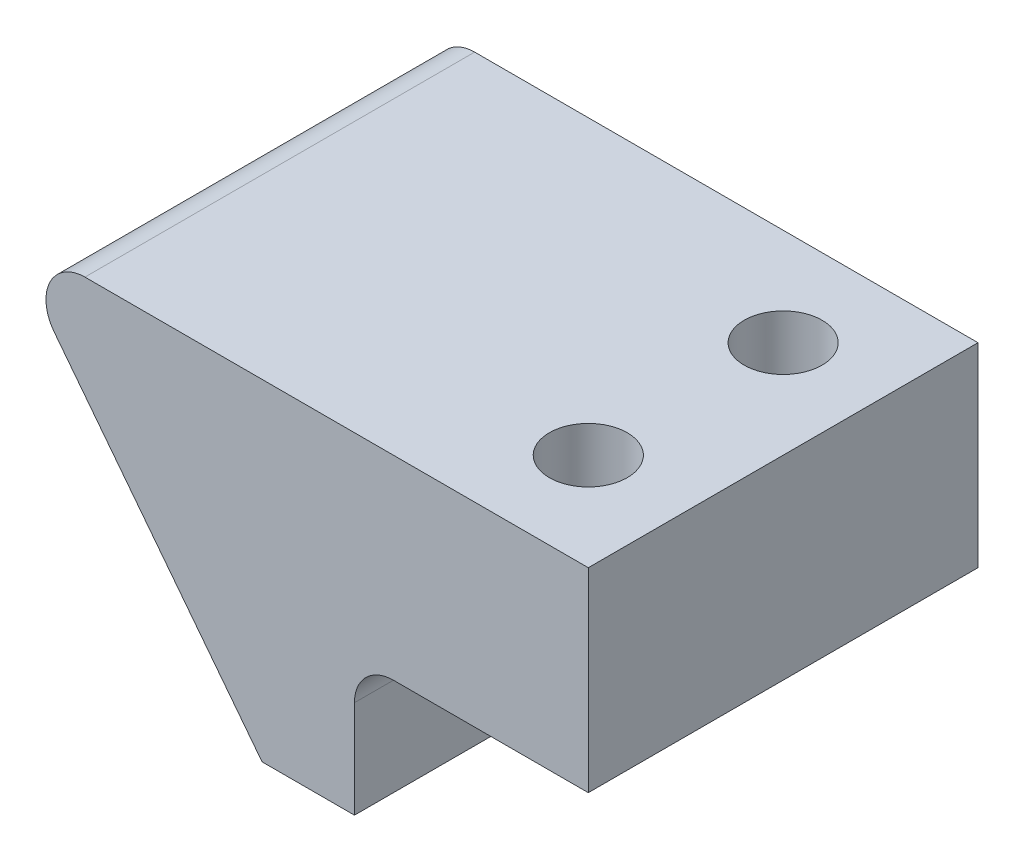
ISO-10303-21;
HEADER;
FILE_DESCRIPTION(('STEP AP214'),'2;1');
FILE_NAME('part.step','',(''),(''),'','','');
FILE_SCHEMA(('AUTOMOTIVE_DESIGN { 1 0 10303 214 1 1 1 1 }'));
ENDSEC;
DATA;
#1=APPLICATION_CONTEXT('core data for automotive mechanical design processes');
#2=APPLICATION_PROTOCOL_DEFINITION('international standard','automotive_design',2000,#1);
#3=PRODUCT_CONTEXT('',#1,'mechanical');
#4=PRODUCT('Part','Part','',(#3));
#5=PRODUCT_RELATED_PRODUCT_CATEGORY('part','',(#4));
#6=PRODUCT_DEFINITION_FORMATION('','',#4);
#7=PRODUCT_DEFINITION_CONTEXT('part definition',#1,'design');
#8=PRODUCT_DEFINITION('design','',#6,#7);
#9=PRODUCT_DEFINITION_SHAPE('','',#8);
#10=(LENGTH_UNIT() NAMED_UNIT(*) SI_UNIT(.MILLI.,.METRE.));
#11=(NAMED_UNIT(*) PLANE_ANGLE_UNIT() SI_UNIT($,.RADIAN.));
#12=(NAMED_UNIT(*) SI_UNIT($,.STERADIAN.) SOLID_ANGLE_UNIT());
#13=UNCERTAINTY_MEASURE_WITH_UNIT(LENGTH_MEASURE(1.E-05),#10,'distance_accuracy_value','');
#14=(GEOMETRIC_REPRESENTATION_CONTEXT(3) GLOBAL_UNCERTAINTY_ASSIGNED_CONTEXT((#13)) GLOBAL_UNIT_ASSIGNED_CONTEXT((#10,
#11,#12)) REPRESENTATION_CONTEXT('',''));
#15=CARTESIAN_POINT('',(0.,0.,0.));
#16=DIRECTION('',(0.,0.,1.));
#17=DIRECTION('',(1.,0.,0.));
#18=AXIS2_PLACEMENT_3D('',#15,#16,#17);
#19=CARTESIAN_POINT('',(21.6293199223756,10.5,-5.));
#20=DIRECTION('',(-0.79051636866041,-0.612440912153947,0.));
#21=DIRECTION('',(0.612440912153947,-0.79051636866041,0.));
#22=AXIS2_PLACEMENT_3D('',#19,#20,#21);
#23=PLANE('',#22);
#24=DIRECTION('',(0.612440912153947,-0.79051636866041,0.));
#25=VECTOR('',#24,1.);
#26=CARTESIAN_POINT('',(21.6293199223756,10.5,5.));
#27=LINE('',#26,#25);
#28=CARTESIAN_POINT('',(16.2932849742028,17.3875590878461,5.));
#29=VERTEX_POINT('',#28);
#30=CARTESIAN_POINT('',(21.6293199223756,10.5,5.));
#31=VERTEX_POINT('',#30);
#32=EDGE_CURVE('E105',#29,#31,#27,.T.);
#33=ORIENTED_EDGE('',*,*,#32,.F.);
#34=DIRECTION('',(0.,0.,1.));
#35=VECTOR('',#34,1.);
#36=CARTESIAN_POINT('',(16.2932849742028,17.3875590878461,-5.));
#37=LINE('',#36,#35);
#38=CARTESIAN_POINT('',(16.2932849742028,17.3875590878461,-5.));
#39=VERTEX_POINT('',#38);
#40=EDGE_CURVE('E58',#29,#39,#37,.F.);
#41=ORIENTED_EDGE('',*,*,#40,.T.);
#42=DIRECTION('',(0.612440912153947,-0.79051636866041,0.));
#43=VECTOR('',#42,1.);
#44=CARTESIAN_POINT('',(21.6293199223756,10.5,-5.));
#45=LINE('',#44,#43);
#46=CARTESIAN_POINT('',(21.6293199223756,10.5,-5.));
#47=VERTEX_POINT('',#46);
#48=EDGE_CURVE('E116',#39,#47,#45,.T.);
#49=ORIENTED_EDGE('',*,*,#48,.T.);
#50=DIRECTION('',(0.,0.,1.));
#51=VECTOR('',#50,1.);
#52=CARTESIAN_POINT('',(21.6293199223756,10.5,-5.));
#53=LINE('',#52,#51);
#54=EDGE_CURVE('E115',#47,#31,#53,.T.);
#55=ORIENTED_EDGE('',*,*,#54,.T.);
#56=EDGE_LOOP('',(#33,#41,#49,#55));
#57=FACE_BOUND('',#56,.T.);
#58=ADVANCED_FACE('F43',(#57),#23,.T.);
#59=CARTESIAN_POINT('',(15.0440701290917,19.,-5.));
#60=DIRECTION('',(0.,1.,0.));
#61=DIRECTION('',(-1.,0.,0.));
#62=AXIS2_PLACEMENT_3D('',#59,#60,#61);
#63=PLANE('',#62);
#64=CARTESIAN_POINT('',(27.5,19.,-2.49999996687377));
#65=DIRECTION('',(0.,-1.,0.));
#66=DIRECTION('',(0.,0.,-1.));
#67=AXIS2_PLACEMENT_3D('',#64,#65,#66);
#68=CIRCLE('',#67,0.999999999999997);
#69=CARTESIAN_POINT('',(27.5,19.,-3.49999996687376));
#70=VERTEX_POINT('',#69);
#71=EDGE_CURVE('E261',#70,#70,#68,.T.);
#72=ORIENTED_EDGE('',*,*,#71,.T.);
#73=EDGE_LOOP('',(#72));
#74=FACE_BOUND('',#73,.T.);
#75=CARTESIAN_POINT('',(27.5,19.,2.50000003312623));
#76=DIRECTION('',(0.,-1.,0.));
#77=DIRECTION('',(0.,0.,-1.));
#78=AXIS2_PLACEMENT_3D('',#75,#76,#77);
#79=CIRCLE('',#78,0.999999999999997);
#80=CARTESIAN_POINT('',(27.5,19.,1.50000003312624));
#81=VERTEX_POINT('',#80);
#82=EDGE_CURVE('E112',#81,#81,#79,.T.);
#83=ORIENTED_EDGE('',*,*,#82,.T.);
#84=EDGE_LOOP('',(#83));
#85=FACE_BOUND('',#84,.T.);
#86=DIRECTION('',(-1.,0.,0.));
#87=VECTOR('',#86,1.);
#88=CARTESIAN_POINT('',(15.0440701290917,19.,-5.));
#89=LINE('',#88,#87);
#90=CARTESIAN_POINT('',(30.,19.,-5.));
#91=VERTEX_POINT('',#90);
#92=CARTESIAN_POINT('',(17.0838013428632,19.,-5.));
#93=VERTEX_POINT('',#92);
#94=EDGE_CURVE('E121',#91,#93,#89,.T.);
#95=ORIENTED_EDGE('',*,*,#94,.T.);
#96=DIRECTION('',(0.,0.,1.));
#97=VECTOR('',#96,1.);
#98=CARTESIAN_POINT('',(17.0838013428632,19.,-5.));
#99=LINE('',#98,#97);
#100=CARTESIAN_POINT('',(17.0838013428632,19.,5.));
#101=VERTEX_POINT('',#100);
#102=EDGE_CURVE('E160',#93,#101,#99,.T.);
#103=ORIENTED_EDGE('',*,*,#102,.T.);
#104=DIRECTION('',(-1.,0.,0.));
#105=VECTOR('',#104,1.);
#106=CARTESIAN_POINT('',(15.0440701290917,19.,5.));
#107=LINE('',#106,#105);
#108=CARTESIAN_POINT('',(30.,19.,5.));
#109=VERTEX_POINT('',#108);
#110=EDGE_CURVE('E134',#109,#101,#107,.T.);
#111=ORIENTED_EDGE('',*,*,#110,.F.);
#112=DIRECTION('',(0.,0.,1.));
#113=VECTOR('',#112,1.);
#114=CARTESIAN_POINT('',(30.,19.,-5.));
#115=LINE('',#114,#113);
#116=EDGE_CURVE('E149',#91,#109,#115,.T.);
#117=ORIENTED_EDGE('',*,*,#116,.F.);
#118=EDGE_LOOP('',(#95,#103,#111,#117));
#119=FACE_BOUND('',#118,.T.);
#120=ADVANCED_FACE('F195',(#74,#85,#119),#63,.T.);
#121=CARTESIAN_POINT('',(30.,19.,-5.));
#122=DIRECTION('',(1.,0.,0.));
#123=DIRECTION('',(0.,1.,0.));
#124=AXIS2_PLACEMENT_3D('',#121,#122,#123);
#125=PLANE('',#124);
#126=ORIENTED_EDGE('',*,*,#116,.T.);
#127=DIRECTION('',(0.,1.,0.));
#128=VECTOR('',#127,1.);
#129=CARTESIAN_POINT('',(30.,19.,5.));
#130=LINE('',#129,#128);
#131=CARTESIAN_POINT('',(30.,14.,5.));
#132=VERTEX_POINT('',#131);
#133=EDGE_CURVE('E131',#132,#109,#130,.T.);
#134=ORIENTED_EDGE('',*,*,#133,.F.);
#135=DIRECTION('',(0.,0.,1.));
#136=VECTOR('',#135,1.);
#137=CARTESIAN_POINT('',(30.,14.,-5.));
#138=LINE('',#137,#136);
#139=CARTESIAN_POINT('',(30.,14.,-5.));
#140=VERTEX_POINT('',#139);
#141=EDGE_CURVE('E152',#140,#132,#138,.T.);
#142=ORIENTED_EDGE('',*,*,#141,.F.);
#143=DIRECTION('',(0.,1.,0.));
#144=VECTOR('',#143,1.);
#145=CARTESIAN_POINT('',(30.,19.,-5.));
#146=LINE('',#145,#144);
#147=EDGE_CURVE('E144',#140,#91,#146,.T.);
#148=ORIENTED_EDGE('',*,*,#147,.T.);
#149=EDGE_LOOP('',(#126,#134,#142,#148));
#150=FACE_BOUND('',#149,.T.);
#151=ADVANCED_FACE('F191',(#150),#125,.T.);
#152=CARTESIAN_POINT('',(30.,14.,-5.));
#153=DIRECTION('',(0.,-1.,0.));
#154=DIRECTION('',(0.,0.,-1.));
#155=AXIS2_PLACEMENT_3D('',#152,#153,#154);
#156=PLANE('',#155);
#157=CARTESIAN_POINT('',(27.5,14.,-2.49999996687377));
#158=DIRECTION('',(0.,-1.,0.));
#159=DIRECTION('',(0.,0.,-1.));
#160=AXIS2_PLACEMENT_3D('',#157,#158,#159);
#161=CIRCLE('',#160,1.);
#162=CARTESIAN_POINT('',(27.5,14.,-3.49999996687377));
#163=VERTEX_POINT('',#162);
#164=EDGE_CURVE('E264',#163,#163,#161,.T.);
#165=ORIENTED_EDGE('',*,*,#164,.F.);
#166=EDGE_LOOP('',(#165));
#167=FACE_BOUND('',#166,.T.);
#168=CARTESIAN_POINT('',(27.5,14.,2.50000003312623));
#169=DIRECTION('',(0.,-1.,0.));
#170=DIRECTION('',(0.,0.,-1.));
#171=AXIS2_PLACEMENT_3D('',#168,#169,#170);
#172=CIRCLE('',#171,1.);
#173=CARTESIAN_POINT('',(27.5,14.,1.50000003312623));
#174=VERTEX_POINT('',#173);
#175=EDGE_CURVE('E266',#174,#174,#172,.T.);
#176=ORIENTED_EDGE('',*,*,#175,.F.);
#177=EDGE_LOOP('',(#176));
#178=FACE_BOUND('',#177,.T.);
#179=DIRECTION('',(1.,0.,0.));
#180=VECTOR('',#179,1.);
#181=CARTESIAN_POINT('',(30.,14.,5.));
#182=LINE('',#181,#180);
#183=CARTESIAN_POINT('',(25.,14.,5.));
#184=VERTEX_POINT('',#183);
#185=EDGE_CURVE('E126',#184,#132,#182,.T.);
#186=ORIENTED_EDGE('',*,*,#185,.F.);
#187=DIRECTION('',(0.,0.,1.));
#188=VECTOR('',#187,1.);
#189=CARTESIAN_POINT('',(25.,14.,-5.));
#190=LINE('',#189,#188);
#191=CARTESIAN_POINT('',(25.,14.,-5.));
#192=VERTEX_POINT('',#191);
#193=EDGE_CURVE('E158',#184,#192,#190,.F.);
#194=ORIENTED_EDGE('',*,*,#193,.T.);
#195=DIRECTION('',(1.,0.,0.));
#196=VECTOR('',#195,1.);
#197=CARTESIAN_POINT('',(30.,14.,-5.));
#198=LINE('',#197,#196);
#199=EDGE_CURVE('E142',#192,#140,#198,.T.);
#200=ORIENTED_EDGE('',*,*,#199,.T.);
#201=ORIENTED_EDGE('',*,*,#141,.T.);
#202=EDGE_LOOP('',(#186,#194,#200,#201));
#203=FACE_BOUND('',#202,.T.);
#204=ADVANCED_FACE('F171',(#167,#178,#203),#156,.T.);
#205=CARTESIAN_POINT('',(24.,14.,-5.));
#206=DIRECTION('',(1.,0.,0.));
#207=DIRECTION('',(0.,0.,-1.));
#208=AXIS2_PLACEMENT_3D('',#205,#206,#207);
#209=PLANE('',#208);
#210=DIRECTION('',(0.,1.,0.));
#211=VECTOR('',#210,1.);
#212=CARTESIAN_POINT('',(24.,14.,-5.));
#213=LINE('',#212,#211);
#214=CARTESIAN_POINT('',(24.,10.5,-5.));
#215=VERTEX_POINT('',#214);
#216=CARTESIAN_POINT('',(24.,13.,-5.));
#217=VERTEX_POINT('',#216);
#218=EDGE_CURVE('E139',#215,#217,#213,.T.);
#219=ORIENTED_EDGE('',*,*,#218,.T.);
#220=DIRECTION('',(0.,0.,1.));
#221=VECTOR('',#220,1.);
#222=CARTESIAN_POINT('',(24.,13.,5.));
#223=LINE('',#222,#221);
#224=CARTESIAN_POINT('',(24.,13.,5.));
#225=VERTEX_POINT('',#224);
#226=EDGE_CURVE('E151',#217,#225,#223,.T.);
#227=ORIENTED_EDGE('',*,*,#226,.T.);
#228=DIRECTION('',(0.,1.,0.));
#229=VECTOR('',#228,1.);
#230=CARTESIAN_POINT('',(24.,14.,5.));
#231=LINE('',#230,#229);
#232=CARTESIAN_POINT('',(24.,10.5,5.));
#233=VERTEX_POINT('',#232);
#234=EDGE_CURVE('E124',#233,#225,#231,.T.);
#235=ORIENTED_EDGE('',*,*,#234,.F.);
#236=DIRECTION('',(0.,0.,1.));
#237=VECTOR('',#236,1.);
#238=CARTESIAN_POINT('',(24.,10.5,-5.));
#239=LINE('',#238,#237);
#240=EDGE_CURVE('E120',#215,#233,#239,.T.);
#241=ORIENTED_EDGE('',*,*,#240,.F.);
#242=EDGE_LOOP('',(#219,#227,#235,#241));
#243=FACE_BOUND('',#242,.T.);
#244=ADVANCED_FACE('F182',(#243),#209,.T.);
#245=CARTESIAN_POINT('',(24.,10.5,-5.));
#246=DIRECTION('',(0.,-1.,0.));
#247=DIRECTION('',(0.,0.,-1.));
#248=AXIS2_PLACEMENT_3D('',#245,#246,#247);
#249=PLANE('',#248);
#250=ORIENTED_EDGE('',*,*,#240,.T.);
#251=DIRECTION('',(1.,0.,0.));
#252=VECTOR('',#251,1.);
#253=CARTESIAN_POINT('',(24.,10.5,5.));
#254=LINE('',#253,#252);
#255=EDGE_CURVE('E110',#31,#233,#254,.T.);
#256=ORIENTED_EDGE('',*,*,#255,.F.);
#257=ORIENTED_EDGE('',*,*,#54,.F.);
#258=DIRECTION('',(1.,0.,0.));
#259=VECTOR('',#258,1.);
#260=CARTESIAN_POINT('',(24.,10.5,-5.));
#261=LINE('',#260,#259);
#262=EDGE_CURVE('E137',#47,#215,#261,.T.);
#263=ORIENTED_EDGE('',*,*,#262,.T.);
#264=EDGE_LOOP('',(#250,#256,#257,#263));
#265=FACE_BOUND('',#264,.T.);
#266=ADVANCED_FACE('F123',(#265),#249,.T.);
#267=CARTESIAN_POINT('',(0.,0.,-5.));
#268=DIRECTION('',(0.,0.,-1.));
#269=DIRECTION('',(-1.,0.,0.));
#270=AXIS2_PLACEMENT_3D('',#267,#268,#269);
#271=PLANE('',#270);
#272=ORIENTED_EDGE('',*,*,#48,.F.);
#273=CARTESIAN_POINT('',(17.0838013428632,18.,-5.));
#274=DIRECTION('',(0.,0.,-1.));
#275=DIRECTION('',(-1.,0.,0.));
#276=AXIS2_PLACEMENT_3D('',#273,#274,#275);
#277=CIRCLE('',#276,1.);
#278=EDGE_CURVE('E165',#39,#93,#277,.T.);
#279=ORIENTED_EDGE('',*,*,#278,.T.);
#280=ORIENTED_EDGE('',*,*,#94,.F.);
#281=ORIENTED_EDGE('',*,*,#147,.F.);
#282=ORIENTED_EDGE('',*,*,#199,.F.);
#283=CARTESIAN_POINT('',(25.,13.,-5.));
#284=DIRECTION('',(0.,0.,-1.));
#285=DIRECTION('',(-1.,0.,0.));
#286=AXIS2_PLACEMENT_3D('',#283,#284,#285);
#287=CIRCLE('',#286,1.);
#288=EDGE_CURVE('E13',#192,#217,#287,.F.);
#289=ORIENTED_EDGE('',*,*,#288,.T.);
#290=ORIENTED_EDGE('',*,*,#218,.F.);
#291=ORIENTED_EDGE('',*,*,#262,.F.);
#292=EDGE_LOOP('',(#272,#279,#280,#281,#282,#289,#290,#291));
#293=FACE_BOUND('',#292,.T.);
#294=ADVANCED_FACE('F179',(#293),#271,.T.);
#295=CARTESIAN_POINT('',(0.,0.,5.));
#296=DIRECTION('',(0.,0.,-1.));
#297=DIRECTION('',(-1.,0.,0.));
#298=AXIS2_PLACEMENT_3D('',#295,#296,#297);
#299=PLANE('',#298);
#300=ORIENTED_EDGE('',*,*,#110,.T.);
#301=CARTESIAN_POINT('',(17.0838013428632,18.,5.));
#302=DIRECTION('',(0.,0.,-1.));
#303=DIRECTION('',(-1.,0.,0.));
#304=AXIS2_PLACEMENT_3D('',#301,#302,#303);
#305=CIRCLE('',#304,1.);
#306=EDGE_CURVE('E66',#101,#29,#305,.F.);
#307=ORIENTED_EDGE('',*,*,#306,.T.);
#308=ORIENTED_EDGE('',*,*,#32,.T.);
#309=ORIENTED_EDGE('',*,*,#255,.T.);
#310=ORIENTED_EDGE('',*,*,#234,.T.);
#311=CARTESIAN_POINT('',(25.,13.,5.));
#312=DIRECTION('',(0.,0.,-1.));
#313=DIRECTION('',(-1.,0.,0.));
#314=AXIS2_PLACEMENT_3D('',#311,#312,#313);
#315=CIRCLE('',#314,1.);
#316=EDGE_CURVE('E51',#225,#184,#315,.T.);
#317=ORIENTED_EDGE('',*,*,#316,.T.);
#318=ORIENTED_EDGE('',*,*,#185,.T.);
#319=ORIENTED_EDGE('',*,*,#133,.T.);
#320=EDGE_LOOP('',(#300,#307,#308,#309,#310,#317,#318,#319));
#321=FACE_BOUND('',#320,.T.);
#322=ADVANCED_FACE('F107',(#321),#299,.F.);
#323=CARTESIAN_POINT('',(25.,13.,-5.));
#324=DIRECTION('',(0.,0.,-1.));
#325=DIRECTION('',(-1.,0.,0.));
#326=AXIS2_PLACEMENT_3D('',#323,#324,#325);
#327=CYLINDRICAL_SURFACE('',#326,1.);
#328=ORIENTED_EDGE('',*,*,#288,.F.);
#329=ORIENTED_EDGE('',*,*,#193,.F.);
#330=ORIENTED_EDGE('',*,*,#316,.F.);
#331=ORIENTED_EDGE('',*,*,#226,.F.);
#332=EDGE_LOOP('',(#328,#329,#330,#331));
#333=FACE_BOUND('',#332,.T.);
#334=ADVANCED_FACE('F176',(#333),#327,.F.);
#335=CARTESIAN_POINT('',(17.0838013428632,18.,-5.));
#336=DIRECTION('',(0.,0.,1.));
#337=DIRECTION('',(1.,0.,0.));
#338=AXIS2_PLACEMENT_3D('',#335,#336,#337);
#339=CYLINDRICAL_SURFACE('',#338,1.);
#340=ORIENTED_EDGE('',*,*,#278,.F.);
#341=ORIENTED_EDGE('',*,*,#40,.F.);
#342=ORIENTED_EDGE('',*,*,#306,.F.);
#343=ORIENTED_EDGE('',*,*,#102,.F.);
#344=EDGE_LOOP('',(#340,#341,#342,#343));
#345=FACE_BOUND('',#344,.T.);
#346=ADVANCED_FACE('F45',(#345),#339,.T.);
#347=CARTESIAN_POINT('',(27.5,14.,2.50000003312623));
#348=DIRECTION('',(0.,-1.,0.));
#349=DIRECTION('',(0.,0.,-1.));
#350=AXIS2_PLACEMENT_3D('',#347,#348,#349);
#351=CYLINDRICAL_SURFACE('',#350,0.999999999999999);
#352=ORIENTED_EDGE('',*,*,#82,.F.);
#353=EDGE_LOOP('',(#352));
#354=FACE_BOUND('',#353,.T.);
#355=ORIENTED_EDGE('',*,*,#175,.T.);
#356=EDGE_LOOP('',(#355));
#357=FACE_BOUND('',#356,.T.);
#358=ADVANCED_FACE('F208',(#354,#357),#351,.F.);
#359=CARTESIAN_POINT('',(27.5,14.,-2.49999996687377));
#360=DIRECTION('',(0.,-1.,0.));
#361=DIRECTION('',(0.,0.,-1.));
#362=AXIS2_PLACEMENT_3D('',#359,#360,#361);
#363=CYLINDRICAL_SURFACE('',#362,0.999999999999999);
#364=ORIENTED_EDGE('',*,*,#71,.F.);
#365=EDGE_LOOP('',(#364));
#366=FACE_BOUND('',#365,.T.);
#367=ORIENTED_EDGE('',*,*,#164,.T.);
#368=EDGE_LOOP('',(#367));
#369=FACE_BOUND('',#368,.T.);
#370=ADVANCED_FACE('F245',(#366,#369),#363,.F.);
#371=CLOSED_SHELL('',(#58,#120,#151,#204,#244,#266,#294,#322,#334,#346,#358,#370));
#372=MANIFOLD_SOLID_BREP('B2',#371);
#373=ADVANCED_BREP_SHAPE_REPRESENTATION('',(#18,#372),#14);
#374=SHAPE_DEFINITION_REPRESENTATION(#9,#373);
ENDSEC;
END-ISO-10303-21;
